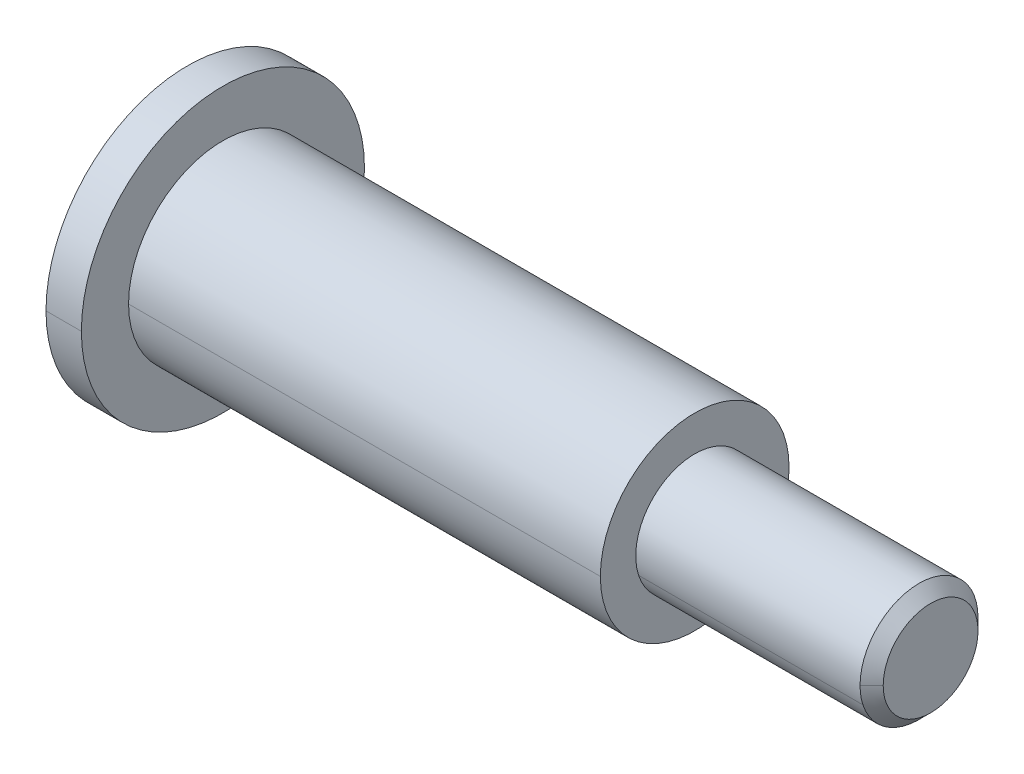
ISO-10303-21;
HEADER;
FILE_DESCRIPTION(('STEP AP214'),'2;1');
FILE_NAME('part.step','',(''),(''),'','','');
FILE_SCHEMA(('AUTOMOTIVE_DESIGN { 1 0 10303 214 1 1 1 1 }'));
ENDSEC;
DATA;
#1=APPLICATION_CONTEXT('core data for automotive mechanical design processes');
#2=APPLICATION_PROTOCOL_DEFINITION('international standard','automotive_design',2000,#1);
#3=PRODUCT_CONTEXT('',#1,'mechanical');
#4=PRODUCT('Part','Part','',(#3));
#5=PRODUCT_RELATED_PRODUCT_CATEGORY('part','',(#4));
#6=PRODUCT_DEFINITION_FORMATION('','',#4);
#7=PRODUCT_DEFINITION_CONTEXT('part definition',#1,'design');
#8=PRODUCT_DEFINITION('design','',#6,#7);
#9=PRODUCT_DEFINITION_SHAPE('','',#8);
#10=(LENGTH_UNIT() NAMED_UNIT(*) SI_UNIT(.MILLI.,.METRE.));
#11=(NAMED_UNIT(*) PLANE_ANGLE_UNIT() SI_UNIT($,.RADIAN.));
#12=(NAMED_UNIT(*) SI_UNIT($,.STERADIAN.) SOLID_ANGLE_UNIT());
#13=UNCERTAINTY_MEASURE_WITH_UNIT(LENGTH_MEASURE(1.E-05),#10,'distance_accuracy_value','');
#14=(GEOMETRIC_REPRESENTATION_CONTEXT(3) GLOBAL_UNCERTAINTY_ASSIGNED_CONTEXT((#13)) GLOBAL_UNIT_ASSIGNED_CONTEXT((#10,
#11,#12)) REPRESENTATION_CONTEXT('',''));
#15=CARTESIAN_POINT('',(0.,0.,0.));
#16=DIRECTION('',(0.,0.,1.));
#17=DIRECTION('',(1.,0.,0.));
#18=AXIS2_PLACEMENT_3D('',#15,#16,#17);
#19=CARTESIAN_POINT('',(-1.5,0.,0.));
#20=DIRECTION('',(1.,0.,0.));
#21=DIRECTION('',(0.,0.,-1.));
#22=AXIS2_PLACEMENT_3D('',#19,#20,#21);
#23=PLANE('',#22);
#24=CARTESIAN_POINT('',(-1.5,0.,0.));
#25=DIRECTION('',(1.,0.,0.));
#26=DIRECTION('',(0.,0.,-1.));
#27=AXIS2_PLACEMENT_3D('',#24,#25,#26);
#28=CIRCLE('',#27,6.);
#29=CARTESIAN_POINT('',(-1.5,0.,6.));
#30=VERTEX_POINT('',#29);
#31=CARTESIAN_POINT('',(-1.5,0.,-6.));
#32=VERTEX_POINT('',#31);
#33=EDGE_CURVE('E10',#30,#32,#28,.T.);
#34=ORIENTED_EDGE('',*,*,#33,.F.);
#35=CARTESIAN_POINT('',(-1.5,0.,0.));
#36=DIRECTION('',(1.,0.,0.));
#37=DIRECTION('',(0.,0.,-1.));
#38=AXIS2_PLACEMENT_3D('',#35,#36,#37);
#39=CIRCLE('',#38,6.);
#40=EDGE_CURVE('E23',#32,#30,#39,.T.);
#41=ORIENTED_EDGE('',*,*,#40,.F.);
#42=EDGE_LOOP('',(#34,#41));
#43=FACE_BOUND('',#42,.T.);
#44=DIRECTION('',(0.,0.500000000000009,-0.866025403784433));
#45=VECTOR('',#44,1.);
#46=CARTESIAN_POINT('',(-1.5,-1.7320508075689,0.));
#47=LINE('',#46,#45);
#48=CARTESIAN_POINT('',(-1.5,-1.7320508075689,0.));
#49=VERTEX_POINT('',#48);
#50=CARTESIAN_POINT('',(-1.5,-0.86602540378444,-1.5));
#51=VERTEX_POINT('',#50);
#52=EDGE_CURVE('E375',#49,#51,#47,.T.);
#53=ORIENTED_EDGE('',*,*,#52,.T.);
#54=DIRECTION('',(0.,1.,0.));
#55=VECTOR('',#54,1.);
#56=CARTESIAN_POINT('',(-1.5,-0.86602540378444,-1.5));
#57=LINE('',#56,#55);
#58=CARTESIAN_POINT('',(-1.5,0.86602540378444,-1.5));
#59=VERTEX_POINT('',#58);
#60=EDGE_CURVE('E371',#51,#59,#57,.T.);
#61=ORIENTED_EDGE('',*,*,#60,.T.);
#62=DIRECTION('',(0.,0.500000000000009,0.866025403784433));
#63=VECTOR('',#62,1.);
#64=CARTESIAN_POINT('',(-1.5,0.86602540378444,-1.5));
#65=LINE('',#64,#63);
#66=CARTESIAN_POINT('',(-1.5,1.7320508075689,0.));
#67=VERTEX_POINT('',#66);
#68=EDGE_CURVE('E367',#59,#67,#65,.T.);
#69=ORIENTED_EDGE('',*,*,#68,.T.);
#70=DIRECTION('',(0.,-0.500000000000009,0.866025403784433));
#71=VECTOR('',#70,1.);
#72=CARTESIAN_POINT('',(-1.5,1.7320508075689,0.));
#73=LINE('',#72,#71);
#74=CARTESIAN_POINT('',(-1.5,0.86602540378444,1.5));
#75=VERTEX_POINT('',#74);
#76=EDGE_CURVE('E363',#67,#75,#73,.T.);
#77=ORIENTED_EDGE('',*,*,#76,.T.);
#78=DIRECTION('',(0.,-1.,0.));
#79=VECTOR('',#78,1.);
#80=CARTESIAN_POINT('',(-1.5,0.86602540378444,1.5));
#81=LINE('',#80,#79);
#82=CARTESIAN_POINT('',(-1.5,-0.86602540378444,1.5));
#83=VERTEX_POINT('',#82);
#84=EDGE_CURVE('E359',#75,#83,#81,.T.);
#85=ORIENTED_EDGE('',*,*,#84,.T.);
#86=DIRECTION('',(0.,-0.500000000000009,-0.866025403784433));
#87=VECTOR('',#86,1.);
#88=CARTESIAN_POINT('',(-1.5,-0.86602540378444,1.5));
#89=LINE('',#88,#87);
#90=EDGE_CURVE('E355',#83,#49,#89,.T.);
#91=ORIENTED_EDGE('',*,*,#90,.T.);
#92=EDGE_LOOP('',(#53,#61,#69,#77,#85,#91));
#93=FACE_BOUND('',#92,.T.);
#94=ADVANCED_FACE('F15',(#43,#93),#23,.F.);
#95=CARTESIAN_POINT('',(1.5,-0.86602540378444,1.5));
#96=DIRECTION('',(0.,0.866025403784433,-0.500000000000009));
#97=DIRECTION('',(0.,0.500000000000009,0.866025403784433));
#98=AXIS2_PLACEMENT_3D('',#95,#96,#97);
#99=PLANE('',#98);
#100=ORIENTED_EDGE('',*,*,#90,.F.);
#101=DIRECTION('',(-1.,0.,0.));
#102=VECTOR('',#101,1.);
#103=CARTESIAN_POINT('',(1.5,-0.86602540378444,1.5));
#104=LINE('',#103,#102);
#105=CARTESIAN_POINT('',(1.5,-0.86602540378444,1.5));
#106=VERTEX_POINT('',#105);
#107=EDGE_CURVE('E350',#106,#83,#104,.T.);
#108=ORIENTED_EDGE('',*,*,#107,.F.);
#109=DIRECTION('',(0.,-0.500000000000009,-0.866025403784433));
#110=VECTOR('',#109,1.);
#111=CARTESIAN_POINT('',(1.5,-0.86602540378444,1.5));
#112=LINE('',#111,#110);
#113=CARTESIAN_POINT('',(1.5,-1.29903810567666,0.750000000000019));
#114=VERTEX_POINT('',#113);
#115=EDGE_CURVE('E346',#106,#114,#112,.T.);
#116=ORIENTED_EDGE('',*,*,#115,.T.);
#117=DIRECTION('',(0.,-0.500000000000009,-0.866025403784433));
#118=VECTOR('',#117,1.);
#119=CARTESIAN_POINT('',(1.5,-0.86602540378444,1.5));
#120=LINE('',#119,#118);
#121=CARTESIAN_POINT('',(1.5,-1.7320508075689,0.));
#122=VERTEX_POINT('',#121);
#123=EDGE_CURVE('E342',#114,#122,#120,.T.);
#124=ORIENTED_EDGE('',*,*,#123,.T.);
#125=DIRECTION('',(-1.,0.,0.));
#126=VECTOR('',#125,1.);
#127=CARTESIAN_POINT('',(1.5,-1.7320508075689,0.));
#128=LINE('',#127,#126);
#129=EDGE_CURVE('E337',#122,#49,#128,.T.);
#130=ORIENTED_EDGE('',*,*,#129,.T.);
#131=EDGE_LOOP('',(#100,#108,#116,#124,#130));
#132=FACE_BOUND('',#131,.T.);
#133=ADVANCED_FACE('F404',(#132),#99,.T.);
#134=CARTESIAN_POINT('',(1.5,-1.7320508075689,0.));
#135=DIRECTION('',(0.,0.866025403784433,0.500000000000009));
#136=DIRECTION('',(0.,-0.500000000000009,0.866025403784433));
#137=AXIS2_PLACEMENT_3D('',#134,#135,#136);
#138=PLANE('',#137);
#139=ORIENTED_EDGE('',*,*,#52,.F.);
#140=ORIENTED_EDGE('',*,*,#129,.F.);
#141=DIRECTION('',(0.,0.500000000000009,-0.866025403784433));
#142=VECTOR('',#141,1.);
#143=CARTESIAN_POINT('',(1.5,-1.7320508075689,0.));
#144=LINE('',#143,#142);
#145=CARTESIAN_POINT('',(1.5,-1.29903810567665,-0.750000000000014));
#146=VERTEX_POINT('',#145);
#147=EDGE_CURVE('E333',#122,#146,#144,.T.);
#148=ORIENTED_EDGE('',*,*,#147,.T.);
#149=DIRECTION('',(0.,0.500000000000009,-0.866025403784433));
#150=VECTOR('',#149,1.);
#151=CARTESIAN_POINT('',(1.5,-1.7320508075689,0.));
#152=LINE('',#151,#150);
#153=CARTESIAN_POINT('',(1.5,-0.86602540378444,-1.5));
#154=VERTEX_POINT('',#153);
#155=EDGE_CURVE('E329',#146,#154,#152,.T.);
#156=ORIENTED_EDGE('',*,*,#155,.T.);
#157=DIRECTION('',(-1.,0.,0.));
#158=VECTOR('',#157,1.);
#159=CARTESIAN_POINT('',(1.5,-0.86602540378444,-1.5));
#160=LINE('',#159,#158);
#161=EDGE_CURVE('E324',#154,#51,#160,.T.);
#162=ORIENTED_EDGE('',*,*,#161,.T.);
#163=EDGE_LOOP('',(#139,#140,#148,#156,#162));
#164=FACE_BOUND('',#163,.T.);
#165=ADVANCED_FACE('F408',(#164),#138,.T.);
#166=CARTESIAN_POINT('',(1.5,-0.86602540378444,-1.5));
#167=DIRECTION('',(0.,0.,1.));
#168=DIRECTION('',(1.,0.,0.));
#169=AXIS2_PLACEMENT_3D('',#166,#167,#168);
#170=PLANE('',#169);
#171=ORIENTED_EDGE('',*,*,#60,.F.);
#172=ORIENTED_EDGE('',*,*,#161,.F.);
#173=DIRECTION('',(0.,1.,0.));
#174=VECTOR('',#173,1.);
#175=CARTESIAN_POINT('',(1.5,-0.86602540378444,-1.5));
#176=LINE('',#175,#174);
#177=CARTESIAN_POINT('',(1.5,0.,-1.5));
#178=VERTEX_POINT('',#177);
#179=EDGE_CURVE('E320',#154,#178,#176,.T.);
#180=ORIENTED_EDGE('',*,*,#179,.T.);
#181=DIRECTION('',(0.,1.,0.));
#182=VECTOR('',#181,1.);
#183=CARTESIAN_POINT('',(1.5,-0.86602540378444,-1.5));
#184=LINE('',#183,#182);
#185=CARTESIAN_POINT('',(1.5,0.86602540378444,-1.5));
#186=VERTEX_POINT('',#185);
#187=EDGE_CURVE('E316',#178,#186,#184,.T.);
#188=ORIENTED_EDGE('',*,*,#187,.T.);
#189=DIRECTION('',(-1.,0.,0.));
#190=VECTOR('',#189,1.);
#191=CARTESIAN_POINT('',(1.5,0.86602540378444,-1.5));
#192=LINE('',#191,#190);
#193=EDGE_CURVE('E311',#186,#59,#192,.T.);
#194=ORIENTED_EDGE('',*,*,#193,.T.);
#195=EDGE_LOOP('',(#171,#172,#180,#188,#194));
#196=FACE_BOUND('',#195,.T.);
#197=ADVANCED_FACE('F420',(#196),#170,.T.);
#198=CARTESIAN_POINT('',(1.5,0.86602540378444,-1.5));
#199=DIRECTION('',(0.,-0.866025403784433,0.500000000000009));
#200=DIRECTION('',(0.,-0.500000000000009,-0.866025403784433));
#201=AXIS2_PLACEMENT_3D('',#198,#199,#200);
#202=PLANE('',#201);
#203=ORIENTED_EDGE('',*,*,#68,.F.);
#204=ORIENTED_EDGE('',*,*,#193,.F.);
#205=DIRECTION('',(0.,0.500000000000009,0.866025403784433));
#206=VECTOR('',#205,1.);
#207=CARTESIAN_POINT('',(1.5,0.86602540378444,-1.5));
#208=LINE('',#207,#206);
#209=CARTESIAN_POINT('',(1.5,1.29903810567666,-0.750000000000019));
#210=VERTEX_POINT('',#209);
#211=EDGE_CURVE('E307',#186,#210,#208,.T.);
#212=ORIENTED_EDGE('',*,*,#211,.T.);
#213=DIRECTION('',(0.,0.500000000000009,0.866025403784433));
#214=VECTOR('',#213,1.);
#215=CARTESIAN_POINT('',(1.5,0.86602540378444,-1.5));
#216=LINE('',#215,#214);
#217=CARTESIAN_POINT('',(1.5,1.7320508075689,0.));
#218=VERTEX_POINT('',#217);
#219=EDGE_CURVE('E303',#210,#218,#216,.T.);
#220=ORIENTED_EDGE('',*,*,#219,.T.);
#221=DIRECTION('',(-1.,0.,0.));
#222=VECTOR('',#221,1.);
#223=CARTESIAN_POINT('',(1.5,1.7320508075689,0.));
#224=LINE('',#223,#222);
#225=EDGE_CURVE('E298',#218,#67,#224,.T.);
#226=ORIENTED_EDGE('',*,*,#225,.T.);
#227=EDGE_LOOP('',(#203,#204,#212,#220,#226));
#228=FACE_BOUND('',#227,.T.);
#229=ADVANCED_FACE('F426',(#228),#202,.T.);
#230=CARTESIAN_POINT('',(1.5,1.7320508075689,0.));
#231=DIRECTION('',(0.,-0.866025403784433,-0.500000000000009));
#232=DIRECTION('',(0.,0.500000000000009,-0.866025403784433));
#233=AXIS2_PLACEMENT_3D('',#230,#231,#232);
#234=PLANE('',#233);
#235=ORIENTED_EDGE('',*,*,#76,.F.);
#236=ORIENTED_EDGE('',*,*,#225,.F.);
#237=DIRECTION('',(0.,-0.500000000000009,0.866025403784433));
#238=VECTOR('',#237,1.);
#239=CARTESIAN_POINT('',(1.5,1.7320508075689,0.));
#240=LINE('',#239,#238);
#241=CARTESIAN_POINT('',(1.5,1.29903810567666,0.750000000000019));
#242=VERTEX_POINT('',#241);
#243=EDGE_CURVE('E294',#218,#242,#240,.T.);
#244=ORIENTED_EDGE('',*,*,#243,.T.);
#245=DIRECTION('',(0.,-0.500000000000009,0.866025403784433));
#246=VECTOR('',#245,1.);
#247=CARTESIAN_POINT('',(1.5,1.7320508075689,0.));
#248=LINE('',#247,#246);
#249=CARTESIAN_POINT('',(1.5,0.86602540378444,1.5));
#250=VERTEX_POINT('',#249);
#251=EDGE_CURVE('E290',#242,#250,#248,.T.);
#252=ORIENTED_EDGE('',*,*,#251,.T.);
#253=DIRECTION('',(-1.,0.,0.));
#254=VECTOR('',#253,1.);
#255=CARTESIAN_POINT('',(1.5,0.86602540378444,1.5));
#256=LINE('',#255,#254);
#257=EDGE_CURVE('E285',#250,#75,#256,.T.);
#258=ORIENTED_EDGE('',*,*,#257,.T.);
#259=EDGE_LOOP('',(#235,#236,#244,#252,#258));
#260=FACE_BOUND('',#259,.T.);
#261=ADVANCED_FACE('F432',(#260),#234,.T.);
#262=CARTESIAN_POINT('',(1.5,0.86602540378444,1.5));
#263=DIRECTION('',(0.,0.,-1.));
#264=DIRECTION('',(-1.,0.,0.));
#265=AXIS2_PLACEMENT_3D('',#262,#263,#264);
#266=PLANE('',#265);
#267=ORIENTED_EDGE('',*,*,#84,.F.);
#268=ORIENTED_EDGE('',*,*,#257,.F.);
#269=DIRECTION('',(0.,-1.,0.));
#270=VECTOR('',#269,1.);
#271=CARTESIAN_POINT('',(1.5,0.86602540378444,1.5));
#272=LINE('',#271,#270);
#273=CARTESIAN_POINT('',(1.5,0.,1.5));
#274=VERTEX_POINT('',#273);
#275=EDGE_CURVE('E281',#250,#274,#272,.T.);
#276=ORIENTED_EDGE('',*,*,#275,.T.);
#277=DIRECTION('',(0.,-1.,0.));
#278=VECTOR('',#277,1.);
#279=CARTESIAN_POINT('',(1.5,0.86602540378444,1.5));
#280=LINE('',#279,#278);
#281=EDGE_CURVE('E276',#274,#106,#280,.T.);
#282=ORIENTED_EDGE('',*,*,#281,.T.);
#283=ORIENTED_EDGE('',*,*,#107,.T.);
#284=EDGE_LOOP('',(#267,#268,#276,#282,#283));
#285=FACE_BOUND('',#284,.T.);
#286=ADVANCED_FACE('F436',(#285),#266,.T.);
#287=CARTESIAN_POINT('',(1.5,0.,0.));
#288=DIRECTION('',(1.,0.,0.));
#289=DIRECTION('',(0.,0.,-1.));
#290=AXIS2_PLACEMENT_3D('',#287,#288,#289);
#291=PLANE('',#290);
#292=CARTESIAN_POINT('',(1.5,0.,0.));
#293=DIRECTION('',(1.,0.,0.));
#294=DIRECTION('',(0.,0.,-1.));
#295=AXIS2_PLACEMENT_3D('',#292,#293,#294);
#296=CIRCLE('',#295,1.5);
#297=EDGE_CURVE('E271',#274,#114,#296,.T.);
#298=ORIENTED_EDGE('',*,*,#297,.T.);
#299=ORIENTED_EDGE('',*,*,#115,.F.);
#300=ORIENTED_EDGE('',*,*,#281,.F.);
#301=EDGE_LOOP('',(#298,#299,#300));
#302=FACE_BOUND('',#301,.T.);
#303=ADVANCED_FACE('F477',(#302),#291,.F.);
#304=CARTESIAN_POINT('',(1.5,0.,0.));
#305=DIRECTION('',(-1.,0.,0.));
#306=DIRECTION('',(0.,1.,0.));
#307=AXIS2_PLACEMENT_3D('',#304,#305,#306);
#308=CONICAL_SURFACE('',#307,1.5,1.04719755119662);
#309=DIRECTION('',(-0.499999999999983,0.,-0.866025403784448));
#310=VECTOR('',#309,1.);
#311=CARTESIAN_POINT('',(2.3660254037844,0.,0.));
#312=LINE('',#311,#310);
#313=CARTESIAN_POINT('',(2.3660254037844,0.,0.));
#314=VERTEX_POINT('',#313);
#315=EDGE_CURVE('E266',#314,#178,#312,.T.);
#316=ORIENTED_EDGE('',*,*,#315,.T.);
#317=CARTESIAN_POINT('',(1.5,0.,0.));
#318=DIRECTION('',(1.,0.,0.));
#319=DIRECTION('',(0.,0.,-1.));
#320=AXIS2_PLACEMENT_3D('',#317,#318,#319);
#321=CIRCLE('',#320,1.5);
#322=EDGE_CURVE('E261',#146,#178,#321,.T.);
#323=ORIENTED_EDGE('',*,*,#322,.F.);
#324=CARTESIAN_POINT('',(1.5,0.,0.));
#325=DIRECTION('',(1.,0.,0.));
#326=DIRECTION('',(0.,0.,-1.));
#327=AXIS2_PLACEMENT_3D('',#324,#325,#326);
#328=CIRCLE('',#327,1.5);
#329=EDGE_CURVE('E256',#114,#146,#328,.T.);
#330=ORIENTED_EDGE('',*,*,#329,.F.);
#331=ORIENTED_EDGE('',*,*,#297,.F.);
#332=DIRECTION('',(-0.499999999999983,0.,0.866025403784448));
#333=VECTOR('',#332,1.);
#334=CARTESIAN_POINT('',(2.3660254037844,0.,0.));
#335=LINE('',#334,#333);
#336=EDGE_CURVE('E251',#314,#274,#335,.T.);
#337=ORIENTED_EDGE('',*,*,#336,.F.);
#338=EDGE_LOOP('',(#316,#323,#330,#331,#337));
#339=FACE_BOUND('',#338,.T.);
#340=ADVANCED_FACE('F445',(#339),#308,.F.);
#341=CARTESIAN_POINT('',(1.5,0.,0.));
#342=DIRECTION('',(-1.,0.,0.));
#343=DIRECTION('',(0.,-1.,0.));
#344=AXIS2_PLACEMENT_3D('',#341,#342,#343);
#345=CONICAL_SURFACE('',#344,1.5,1.04719755119662);
#346=ORIENTED_EDGE('',*,*,#336,.T.);
#347=CARTESIAN_POINT('',(1.5,0.,0.));
#348=DIRECTION('',(1.,0.,0.));
#349=DIRECTION('',(0.,0.,-1.));
#350=AXIS2_PLACEMENT_3D('',#347,#348,#349);
#351=CIRCLE('',#350,1.5);
#352=EDGE_CURVE('E246',#242,#274,#351,.T.);
#353=ORIENTED_EDGE('',*,*,#352,.F.);
#354=CARTESIAN_POINT('',(1.5,0.,0.));
#355=DIRECTION('',(1.,0.,0.));
#356=DIRECTION('',(0.,0.,-1.));
#357=AXIS2_PLACEMENT_3D('',#354,#355,#356);
#358=CIRCLE('',#357,1.5);
#359=EDGE_CURVE('E241',#210,#242,#358,.T.);
#360=ORIENTED_EDGE('',*,*,#359,.F.);
#361=CARTESIAN_POINT('',(1.5,0.,0.));
#362=DIRECTION('',(1.,0.,0.));
#363=DIRECTION('',(0.,0.,-1.));
#364=AXIS2_PLACEMENT_3D('',#361,#362,#363);
#365=CIRCLE('',#364,1.5);
#366=EDGE_CURVE('E236',#178,#210,#365,.T.);
#367=ORIENTED_EDGE('',*,*,#366,.F.);
#368=ORIENTED_EDGE('',*,*,#315,.F.);
#369=EDGE_LOOP('',(#346,#353,#360,#367,#368));
#370=FACE_BOUND('',#369,.T.);
#371=ADVANCED_FACE('F470',(#370),#345,.F.);
#372=CARTESIAN_POINT('',(1.5,0.,0.));
#373=DIRECTION('',(1.,0.,0.));
#374=DIRECTION('',(0.,0.,-1.));
#375=AXIS2_PLACEMENT_3D('',#372,#373,#374);
#376=PLANE('',#375);
#377=ORIENTED_EDGE('',*,*,#366,.T.);
#378=ORIENTED_EDGE('',*,*,#211,.F.);
#379=ORIENTED_EDGE('',*,*,#187,.F.);
#380=EDGE_LOOP('',(#377,#378,#379));
#381=FACE_BOUND('',#380,.T.);
#382=ADVANCED_FACE('F466',(#381),#376,.F.);
#383=CARTESIAN_POINT('',(1.5,0.,0.));
#384=DIRECTION('',(1.,0.,0.));
#385=DIRECTION('',(0.,0.,-1.));
#386=AXIS2_PLACEMENT_3D('',#383,#384,#385);
#387=PLANE('',#386);
#388=ORIENTED_EDGE('',*,*,#219,.F.);
#389=ORIENTED_EDGE('',*,*,#359,.T.);
#390=ORIENTED_EDGE('',*,*,#243,.F.);
#391=EDGE_LOOP('',(#388,#389,#390));
#392=FACE_BOUND('',#391,.T.);
#393=ADVANCED_FACE('F459',(#392),#387,.F.);
#394=CARTESIAN_POINT('',(1.5,0.,0.));
#395=DIRECTION('',(1.,0.,0.));
#396=DIRECTION('',(0.,0.,-1.));
#397=AXIS2_PLACEMENT_3D('',#394,#395,#396);
#398=PLANE('',#397);
#399=ORIENTED_EDGE('',*,*,#352,.T.);
#400=ORIENTED_EDGE('',*,*,#275,.F.);
#401=ORIENTED_EDGE('',*,*,#251,.F.);
#402=EDGE_LOOP('',(#399,#400,#401));
#403=FACE_BOUND('',#402,.T.);
#404=ADVANCED_FACE('F452',(#403),#398,.F.);
#405=CARTESIAN_POINT('',(1.5,0.,0.));
#406=DIRECTION('',(1.,0.,0.));
#407=DIRECTION('',(0.,0.,-1.));
#408=AXIS2_PLACEMENT_3D('',#405,#406,#407);
#409=PLANE('',#408);
#410=ORIENTED_EDGE('',*,*,#329,.T.);
#411=ORIENTED_EDGE('',*,*,#147,.F.);
#412=ORIENTED_EDGE('',*,*,#123,.F.);
#413=EDGE_LOOP('',(#410,#411,#412));
#414=FACE_BOUND('',#413,.T.);
#415=ADVANCED_FACE('F450',(#414),#409,.F.);
#416=CARTESIAN_POINT('',(1.5,0.,0.));
#417=DIRECTION('',(1.,0.,0.));
#418=DIRECTION('',(0.,0.,-1.));
#419=AXIS2_PLACEMENT_3D('',#416,#417,#418);
#420=PLANE('',#419);
#421=ORIENTED_EDGE('',*,*,#322,.T.);
#422=ORIENTED_EDGE('',*,*,#179,.F.);
#423=ORIENTED_EDGE('',*,*,#155,.F.);
#424=EDGE_LOOP('',(#421,#422,#423));
#425=FACE_BOUND('',#424,.T.);
#426=ADVANCED_FACE('F449',(#425),#420,.F.);
#427=CARTESIAN_POINT('',(20.,0.,0.));
#428=DIRECTION('',(1.,0.,0.));
#429=DIRECTION('',(0.,-1.,0.));
#430=AXIS2_PLACEMENT_3D('',#427,#428,#429);
#431=CYLINDRICAL_SURFACE('',#430,6.);
#432=DIRECTION('',(1.,0.,0.));
#433=VECTOR('',#432,1.);
#434=CARTESIAN_POINT('',(-1.5,0.,6.));
#435=LINE('',#434,#433);
#436=CARTESIAN_POINT('',(0.,0.,6.));
#437=VERTEX_POINT('',#436);
#438=EDGE_CURVE('E232',#30,#437,#435,.T.);
#439=ORIENTED_EDGE('',*,*,#438,.T.);
#440=CARTESIAN_POINT('',(0.,0.,0.));
#441=DIRECTION('',(1.,0.,0.));
#442=DIRECTION('',(0.,0.,-1.));
#443=AXIS2_PLACEMENT_3D('',#440,#441,#442);
#444=CIRCLE('',#443,6.);
#445=CARTESIAN_POINT('',(0.,0.,-6.));
#446=VERTEX_POINT('',#445);
#447=EDGE_CURVE('E227',#446,#437,#444,.T.);
#448=ORIENTED_EDGE('',*,*,#447,.F.);
#449=DIRECTION('',(1.,0.,0.));
#450=VECTOR('',#449,1.);
#451=CARTESIAN_POINT('',(-1.5,0.,-6.));
#452=LINE('',#451,#450);
#453=EDGE_CURVE('E222',#32,#446,#452,.T.);
#454=ORIENTED_EDGE('',*,*,#453,.F.);
#455=ORIENTED_EDGE('',*,*,#40,.T.);
#456=EDGE_LOOP('',(#439,#448,#454,#455));
#457=FACE_BOUND('',#456,.T.);
#458=ADVANCED_FACE('F384',(#457),#431,.T.);
#459=CARTESIAN_POINT('',(20.,0.,0.));
#460=DIRECTION('',(1.,0.,0.));
#461=DIRECTION('',(0.,1.,0.));
#462=AXIS2_PLACEMENT_3D('',#459,#460,#461);
#463=CYLINDRICAL_SURFACE('',#462,6.);
#464=ORIENTED_EDGE('',*,*,#438,.F.);
#465=ORIENTED_EDGE('',*,*,#33,.T.);
#466=ORIENTED_EDGE('',*,*,#453,.T.);
#467=CARTESIAN_POINT('',(0.,0.,0.));
#468=DIRECTION('',(1.,0.,0.));
#469=DIRECTION('',(0.,0.,-1.));
#470=AXIS2_PLACEMENT_3D('',#467,#468,#469);
#471=CIRCLE('',#470,6.);
#472=EDGE_CURVE('E217',#437,#446,#471,.T.);
#473=ORIENTED_EDGE('',*,*,#472,.F.);
#474=EDGE_LOOP('',(#464,#465,#466,#473));
#475=FACE_BOUND('',#474,.T.);
#476=ADVANCED_FACE('F387',(#475),#463,.T.);
#477=CARTESIAN_POINT('',(0.,6.,0.));
#478=DIRECTION('',(-1.,0.,0.));
#479=DIRECTION('',(0.,0.,1.));
#480=AXIS2_PLACEMENT_3D('',#477,#478,#479);
#481=PLANE('',#480);
#482=CARTESIAN_POINT('',(0.,0.,0.));
#483=DIRECTION('',(1.,0.,0.));
#484=DIRECTION('',(0.,0.,-1.));
#485=AXIS2_PLACEMENT_3D('',#482,#483,#484);
#486=CIRCLE('',#485,4.);
#487=CARTESIAN_POINT('',(0.,0.,4.));
#488=VERTEX_POINT('',#487);
#489=CARTESIAN_POINT('',(0.,0.,-4.));
#490=VERTEX_POINT('',#489);
#491=EDGE_CURVE('E212',#488,#490,#486,.T.);
#492=ORIENTED_EDGE('',*,*,#491,.F.);
#493=CARTESIAN_POINT('',(0.,0.,0.));
#494=DIRECTION('',(1.,0.,0.));
#495=DIRECTION('',(0.,0.,-1.));
#496=AXIS2_PLACEMENT_3D('',#493,#494,#495);
#497=CIRCLE('',#496,4.);
#498=EDGE_CURVE('E207',#490,#488,#497,.T.);
#499=ORIENTED_EDGE('',*,*,#498,.F.);
#500=EDGE_LOOP('',(#492,#499));
#501=FACE_BOUND('',#500,.T.);
#502=ORIENTED_EDGE('',*,*,#447,.T.);
#503=ORIENTED_EDGE('',*,*,#472,.T.);
#504=EDGE_LOOP('',(#502,#503));
#505=FACE_BOUND('',#504,.T.);
#506=ADVANCED_FACE('F389',(#501,#505),#481,.F.);
#507=CARTESIAN_POINT('',(20.,0.,0.));
#508=DIRECTION('',(1.,0.,0.));
#509=DIRECTION('',(0.,-1.,0.));
#510=AXIS2_PLACEMENT_3D('',#507,#508,#509);
#511=CYLINDRICAL_SURFACE('',#510,4.);
#512=DIRECTION('',(1.,0.,0.));
#513=VECTOR('',#512,1.);
#514=CARTESIAN_POINT('',(0.,0.,4.));
#515=LINE('',#514,#513);
#516=CARTESIAN_POINT('',(20.,0.,4.));
#517=VERTEX_POINT('',#516);
#518=EDGE_CURVE('E203',#488,#517,#515,.T.);
#519=ORIENTED_EDGE('',*,*,#518,.T.);
#520=CARTESIAN_POINT('',(20.,0.,0.));
#521=DIRECTION('',(1.,0.,0.));
#522=DIRECTION('',(0.,0.,-1.));
#523=AXIS2_PLACEMENT_3D('',#520,#521,#522);
#524=CIRCLE('',#523,4.);
#525=CARTESIAN_POINT('',(20.,0.,-4.));
#526=VERTEX_POINT('',#525);
#527=EDGE_CURVE('E198',#526,#517,#524,.T.);
#528=ORIENTED_EDGE('',*,*,#527,.F.);
#529=DIRECTION('',(1.,0.,0.));
#530=VECTOR('',#529,1.);
#531=CARTESIAN_POINT('',(0.,0.,-4.));
#532=LINE('',#531,#530);
#533=EDGE_CURVE('E193',#490,#526,#532,.T.);
#534=ORIENTED_EDGE('',*,*,#533,.F.);
#535=ORIENTED_EDGE('',*,*,#498,.T.);
#536=EDGE_LOOP('',(#519,#528,#534,#535));
#537=FACE_BOUND('',#536,.T.);
#538=ADVANCED_FACE('F391',(#537),#511,.T.);
#539=CARTESIAN_POINT('',(20.,0.,0.));
#540=DIRECTION('',(1.,0.,0.));
#541=DIRECTION('',(0.,1.,0.));
#542=AXIS2_PLACEMENT_3D('',#539,#540,#541);
#543=CYLINDRICAL_SURFACE('',#542,4.);
#544=ORIENTED_EDGE('',*,*,#518,.F.);
#545=ORIENTED_EDGE('',*,*,#491,.T.);
#546=ORIENTED_EDGE('',*,*,#533,.T.);
#547=CARTESIAN_POINT('',(20.,0.,0.));
#548=DIRECTION('',(1.,0.,0.));
#549=DIRECTION('',(0.,0.,-1.));
#550=AXIS2_PLACEMENT_3D('',#547,#548,#549);
#551=CIRCLE('',#550,4.);
#552=EDGE_CURVE('E188',#517,#526,#551,.T.);
#553=ORIENTED_EDGE('',*,*,#552,.F.);
#554=EDGE_LOOP('',(#544,#545,#546,#553));
#555=FACE_BOUND('',#554,.T.);
#556=ADVANCED_FACE('F399',(#555),#543,.T.);
#557=CARTESIAN_POINT('',(20.,4.,0.));
#558=DIRECTION('',(-1.,0.,0.));
#559=DIRECTION('',(0.,0.,1.));
#560=AXIS2_PLACEMENT_3D('',#557,#558,#559);
#561=PLANE('',#560);
#562=CARTESIAN_POINT('',(20.,0.,0.));
#563=DIRECTION('',(1.,0.,0.));
#564=DIRECTION('',(0.,0.,-1.));
#565=AXIS2_PLACEMENT_3D('',#562,#563,#564);
#566=CIRCLE('',#565,2.5);
#567=CARTESIAN_POINT('',(20.,-0.772542485937367,2.37764129073788));
#568=VERTEX_POINT('',#567);
#569=CARTESIAN_POINT('',(20.,0.,-2.5));
#570=VERTEX_POINT('',#569);
#571=EDGE_CURVE('E183',#568,#570,#566,.T.);
#572=ORIENTED_EDGE('',*,*,#571,.F.);
#573=CARTESIAN_POINT('',(20.,0.,0.));
#574=DIRECTION('',(1.,0.,0.));
#575=DIRECTION('',(0.,0.,-1.));
#576=AXIS2_PLACEMENT_3D('',#573,#574,#575);
#577=CIRCLE('',#576,2.5);
#578=EDGE_CURVE('E178',#570,#568,#577,.T.);
#579=ORIENTED_EDGE('',*,*,#578,.F.);
#580=EDGE_LOOP('',(#572,#579));
#581=FACE_BOUND('',#580,.T.);
#582=ORIENTED_EDGE('',*,*,#527,.T.);
#583=ORIENTED_EDGE('',*,*,#552,.T.);
#584=EDGE_LOOP('',(#582,#583));
#585=FACE_BOUND('',#584,.T.);
#586=ADVANCED_FACE('F581',(#581,#585),#561,.F.);
#587=CARTESIAN_POINT('',(30.,0.,0.));
#588=DIRECTION('',(1.,0.,0.));
#589=DIRECTION('',(0.,-0.987688340595138,-0.156434465040231));
#590=AXIS2_PLACEMENT_3D('',#587,#588,#589);
#591=CYLINDRICAL_SURFACE('',#590,2.5);
#592=DIRECTION('',(1.,0.,0.));
#593=VECTOR('',#592,1.);
#594=CARTESIAN_POINT('',(20.,-0.772542485937367,2.37764129073788));
#595=LINE('',#594,#593);
#596=CARTESIAN_POINT('',(29.5095,-0.772542485937367,2.37764129073788));
#597=VERTEX_POINT('',#596);
#598=EDGE_CURVE('E174',#568,#597,#595,.T.);
#599=ORIENTED_EDGE('',*,*,#598,.T.);
#600=CARTESIAN_POINT('',(29.5095,0.,0.));
#601=DIRECTION('',(1.,0.,0.));
#602=DIRECTION('',(0.,0.,-1.));
#603=AXIS2_PLACEMENT_3D('',#600,#601,#602);
#604=CIRCLE('',#603,2.5);
#605=CARTESIAN_POINT('',(29.5095,0.,2.5));
#606=VERTEX_POINT('',#605);
#607=EDGE_CURVE('E170',#606,#597,#604,.T.);
#608=ORIENTED_EDGE('',*,*,#607,.F.);
#609=CARTESIAN_POINT('',(29.5095,0.,0.));
#610=DIRECTION('',(1.,0.,0.));
#611=DIRECTION('',(0.,0.,-1.));
#612=AXIS2_PLACEMENT_3D('',#609,#610,#611);
#613=CIRCLE('',#612,2.5);
#614=CARTESIAN_POINT('',(29.5095,0.,-2.5));
#615=VERTEX_POINT('',#614);
#616=EDGE_CURVE('E148',#615,#606,#613,.T.);
#617=ORIENTED_EDGE('',*,*,#616,.F.);
#618=DIRECTION('',(1.,0.,0.));
#619=VECTOR('',#618,1.);
#620=CARTESIAN_POINT('',(20.,0.,-2.5));
#621=LINE('',#620,#619);
#622=EDGE_CURVE('E162',#570,#615,#621,.T.);
#623=ORIENTED_EDGE('',*,*,#622,.F.);
#624=ORIENTED_EDGE('',*,*,#578,.T.);
#625=EDGE_LOOP('',(#599,#608,#617,#623,#624));
#626=FACE_BOUND('',#625,.T.);
#627=ADVANCED_FACE('F591',(#626),#591,.T.);
#628=CARTESIAN_POINT('',(30.,0.,0.));
#629=DIRECTION('',(1.,0.,0.));
#630=DIRECTION('',(0.,0.987688340595138,0.156434465040231));
#631=AXIS2_PLACEMENT_3D('',#628,#629,#630);
#632=CYLINDRICAL_SURFACE('',#631,2.5);
#633=ORIENTED_EDGE('',*,*,#598,.F.);
#634=ORIENTED_EDGE('',*,*,#571,.T.);
#635=ORIENTED_EDGE('',*,*,#622,.T.);
#636=CARTESIAN_POINT('',(29.5095,0.,0.));
#637=DIRECTION('',(1.,0.,0.));
#638=DIRECTION('',(0.,0.,-1.));
#639=AXIS2_PLACEMENT_3D('',#636,#637,#638);
#640=CIRCLE('',#639,2.5);
#641=EDGE_CURVE('E158',#597,#615,#640,.T.);
#642=ORIENTED_EDGE('',*,*,#641,.F.);
#643=EDGE_LOOP('',(#633,#634,#635,#642));
#644=FACE_BOUND('',#643,.T.);
#645=ADVANCED_FACE('F601',(#644),#632,.T.);
#646=CARTESIAN_POINT('',(29.5095,0.,0.));
#647=DIRECTION('',(-1.,0.,0.));
#648=DIRECTION('',(0.,1.,0.));
#649=AXIS2_PLACEMENT_3D('',#646,#647,#648);
#650=CONICAL_SURFACE('',#649,2.5,0.78539816339745);
#651=DIRECTION('',(-0.707106781186547,0.,-0.707106781186548));
#652=VECTOR('',#651,1.);
#653=CARTESIAN_POINT('',(30.,0.,-2.0095));
#654=LINE('',#653,#652);
#655=CARTESIAN_POINT('',(30.,0.,-2.0095));
#656=VERTEX_POINT('',#655);
#657=EDGE_CURVE('E139',#656,#615,#654,.T.);
#658=ORIENTED_EDGE('',*,*,#657,.F.);
#659=CARTESIAN_POINT('',(30.,0.,0.));
#660=DIRECTION('',(1.,0.,0.));
#661=DIRECTION('',(0.,0.,-1.));
#662=AXIS2_PLACEMENT_3D('',#659,#660,#661);
#663=CIRCLE('',#662,2.0095);
#664=CARTESIAN_POINT('',(30.,0.,2.0095));
#665=VERTEX_POINT('',#664);
#666=EDGE_CURVE('E130',#665,#656,#663,.T.);
#667=ORIENTED_EDGE('',*,*,#666,.F.);
#668=DIRECTION('',(-0.707106781186547,0.,0.707106781186548));
#669=VECTOR('',#668,1.);
#670=CARTESIAN_POINT('',(30.,0.,2.0095));
#671=LINE('',#670,#669);
#672=EDGE_CURVE('E135',#665,#606,#671,.T.);
#673=ORIENTED_EDGE('',*,*,#672,.T.);
#674=ORIENTED_EDGE('',*,*,#607,.T.);
#675=ORIENTED_EDGE('',*,*,#641,.T.);
#676=EDGE_LOOP('',(#658,#667,#673,#674,#675));
#677=FACE_BOUND('',#676,.T.);
#678=ADVANCED_FACE('F132',(#677),#650,.T.);
#679=CARTESIAN_POINT('',(29.5095,0.,0.));
#680=DIRECTION('',(-1.,0.,0.));
#681=DIRECTION('',(0.,-1.,0.));
#682=AXIS2_PLACEMENT_3D('',#679,#680,#681);
#683=CONICAL_SURFACE('',#682,2.5,0.78539816339745);
#684=ORIENTED_EDGE('',*,*,#657,.T.);
#685=ORIENTED_EDGE('',*,*,#616,.T.);
#686=ORIENTED_EDGE('',*,*,#672,.F.);
#687=CARTESIAN_POINT('',(30.,0.,0.));
#688=DIRECTION('',(1.,0.,0.));
#689=DIRECTION('',(0.,0.,-1.));
#690=AXIS2_PLACEMENT_3D('',#687,#688,#689);
#691=CIRCLE('',#690,2.0095);
#692=EDGE_CURVE('E143',#656,#665,#691,.T.);
#693=ORIENTED_EDGE('',*,*,#692,.F.);
#694=EDGE_LOOP('',(#684,#685,#686,#693));
#695=FACE_BOUND('',#694,.T.);
#696=ADVANCED_FACE('F147',(#695),#683,.T.);
#697=CARTESIAN_POINT('',(30.,2.0095,0.));
#698=DIRECTION('',(-1.,0.,0.));
#699=DIRECTION('',(0.,0.,1.));
#700=AXIS2_PLACEMENT_3D('',#697,#698,#699);
#701=PLANE('',#700);
#702=ORIENTED_EDGE('',*,*,#692,.T.);
#703=ORIENTED_EDGE('',*,*,#666,.T.);
#704=EDGE_LOOP('',(#702,#703));
#705=FACE_BOUND('',#704,.T.);
#706=ADVANCED_FACE('F144',(#705),#701,.F.);
#707=CLOSED_SHELL('',(#94,#133,#165,#197,#229,#261,#286,#303,#340,#371,#382,#393,#404,#415,#426,
#458,#476,#506,#538,#556,#586,#627,#645,#678,#696,#706));
#708=MANIFOLD_SOLID_BREP('B1',#707);
#709=ADVANCED_BREP_SHAPE_REPRESENTATION('',(#18,#708),#14);
#710=SHAPE_DEFINITION_REPRESENTATION(#9,#709);
ENDSEC;
END-ISO-10303-21;
